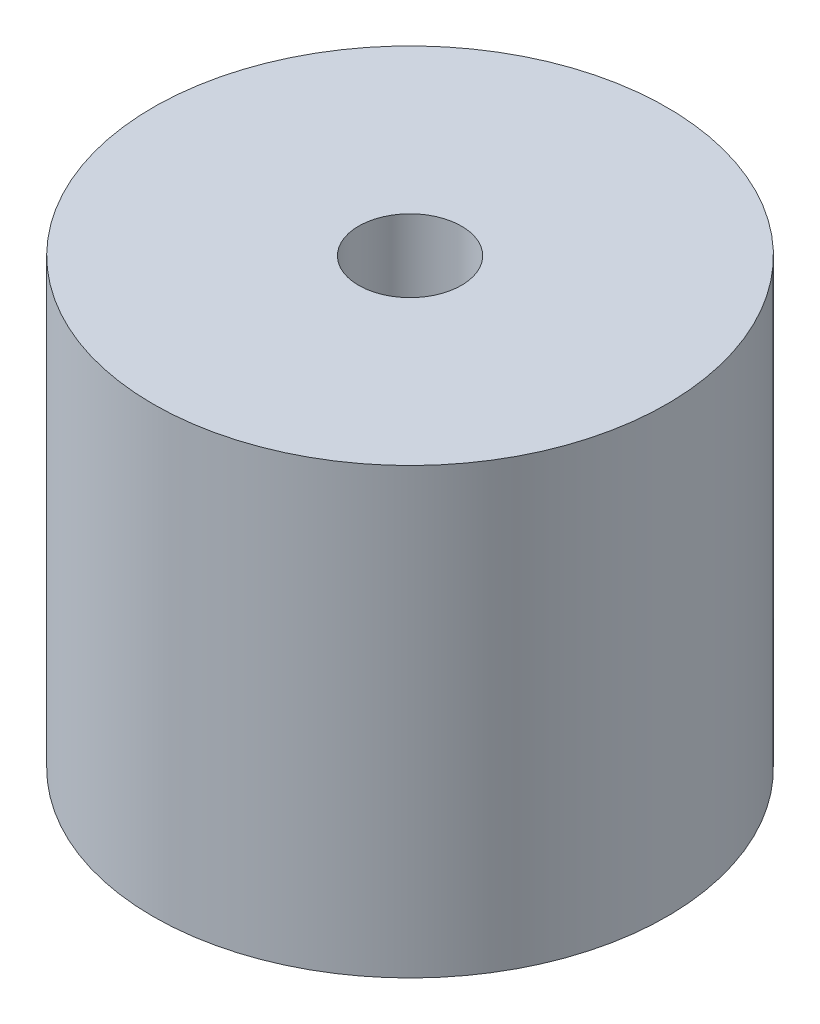
ISO-10303-21;
HEADER;
FILE_DESCRIPTION(('STEP AP214'),'2;1');
FILE_NAME('part.step','',(''),(''),'','','');
FILE_SCHEMA(('AUTOMOTIVE_DESIGN { 1 0 10303 214 1 1 1 1 }'));
ENDSEC;
DATA;
#1=APPLICATION_CONTEXT('core data for automotive mechanical design processes');
#2=APPLICATION_PROTOCOL_DEFINITION('international standard','automotive_design',2000,#1);
#3=PRODUCT_CONTEXT('',#1,'mechanical');
#4=PRODUCT('Part','Part','',(#3));
#5=PRODUCT_RELATED_PRODUCT_CATEGORY('part','',(#4));
#6=PRODUCT_DEFINITION_FORMATION('','',#4);
#7=PRODUCT_DEFINITION_CONTEXT('part definition',#1,'design');
#8=PRODUCT_DEFINITION('design','',#6,#7);
#9=PRODUCT_DEFINITION_SHAPE('','',#8);
#10=(LENGTH_UNIT() NAMED_UNIT(*) SI_UNIT(.MILLI.,.METRE.));
#11=(NAMED_UNIT(*) PLANE_ANGLE_UNIT() SI_UNIT($,.RADIAN.));
#12=(NAMED_UNIT(*) SI_UNIT($,.STERADIAN.) SOLID_ANGLE_UNIT());
#13=UNCERTAINTY_MEASURE_WITH_UNIT(LENGTH_MEASURE(1.E-05),#10,'distance_accuracy_value','');
#14=(GEOMETRIC_REPRESENTATION_CONTEXT(3) GLOBAL_UNCERTAINTY_ASSIGNED_CONTEXT((#13)) GLOBAL_UNIT_ASSIGNED_CONTEXT((#10,
#11,#12)) REPRESENTATION_CONTEXT('',''));
#15=CARTESIAN_POINT('',(0.,0.,0.));
#16=DIRECTION('',(0.,0.,1.));
#17=DIRECTION('',(1.,0.,0.));
#18=AXIS2_PLACEMENT_3D('',#15,#16,#17);
#19=CARTESIAN_POINT('',(0.,86.36,0.));
#20=DIRECTION('',(0.,1.,0.));
#21=DIRECTION('',(0.,0.,1.));
#22=AXIS2_PLACEMENT_3D('',#19,#20,#21);
#23=PLANE('',#22);
#24=CARTESIAN_POINT('',(0.,86.36,0.));
#25=DIRECTION('',(0.,1.,0.));
#26=DIRECTION('',(0.,0.,1.));
#27=AXIS2_PLACEMENT_3D('',#24,#25,#26);
#28=CIRCLE('',#27,50.);
#29=CARTESIAN_POINT('',(0.,86.36,50.));
#30=VERTEX_POINT('',#29);
#31=EDGE_CURVE('E10',#30,#30,#28,.T.);
#32=ORIENTED_EDGE('',*,*,#31,.T.);
#33=EDGE_LOOP('',(#32));
#34=FACE_BOUND('',#33,.T.);
#35=CARTESIAN_POINT('',(0.,86.36,0.));
#36=DIRECTION('',(0.,1.,0.));
#37=DIRECTION('',(0.,0.,1.));
#38=AXIS2_PLACEMENT_3D('',#35,#36,#37);
#39=CIRCLE('',#38,10.);
#40=CARTESIAN_POINT('',(0.,86.36,10.));
#41=VERTEX_POINT('',#40);
#42=EDGE_CURVE('E50',#41,#41,#39,.T.);
#43=ORIENTED_EDGE('',*,*,#42,.F.);
#44=EDGE_LOOP('',(#43));
#45=FACE_BOUND('',#44,.T.);
#46=ADVANCED_FACE('F37',(#34,#45),#23,.T.);
#47=CARTESIAN_POINT('',(0.,0.,0.));
#48=DIRECTION('',(0.,1.,0.));
#49=DIRECTION('',(0.,0.,1.));
#50=AXIS2_PLACEMENT_3D('',#47,#48,#49);
#51=PLANE('',#50);
#52=CARTESIAN_POINT('',(0.,0.,0.));
#53=DIRECTION('',(0.,1.,0.));
#54=DIRECTION('',(0.,0.,1.));
#55=AXIS2_PLACEMENT_3D('',#52,#53,#54);
#56=CIRCLE('',#55,50.);
#57=CARTESIAN_POINT('',(0.,0.,50.));
#58=VERTEX_POINT('',#57);
#59=EDGE_CURVE('E41',#58,#58,#56,.T.);
#60=ORIENTED_EDGE('',*,*,#59,.F.);
#61=EDGE_LOOP('',(#60));
#62=FACE_BOUND('',#61,.T.);
#63=CARTESIAN_POINT('',(0.,0.,0.));
#64=DIRECTION('',(0.,1.,0.));
#65=DIRECTION('',(0.,0.,1.));
#66=AXIS2_PLACEMENT_3D('',#63,#64,#65);
#67=CIRCLE('',#66,10.);
#68=CARTESIAN_POINT('',(0.,0.,10.));
#69=VERTEX_POINT('',#68);
#70=EDGE_CURVE('E52',#69,#69,#67,.T.);
#71=ORIENTED_EDGE('',*,*,#70,.T.);
#72=EDGE_LOOP('',(#71));
#73=FACE_BOUND('',#72,.T.);
#74=ADVANCED_FACE('F64',(#62,#73),#51,.F.);
#75=CARTESIAN_POINT('',(0.,86.36,0.));
#76=DIRECTION('',(0.,-1.,0.));
#77=DIRECTION('',(0.,0.,-1.));
#78=AXIS2_PLACEMENT_3D('',#75,#76,#77);
#79=CYLINDRICAL_SURFACE('',#78,50.);
#80=ORIENTED_EDGE('',*,*,#31,.F.);
#81=EDGE_LOOP('',(#80));
#82=FACE_BOUND('',#81,.T.);
#83=ORIENTED_EDGE('',*,*,#59,.T.);
#84=EDGE_LOOP('',(#83));
#85=FACE_BOUND('',#84,.T.);
#86=ADVANCED_FACE('F39',(#82,#85),#79,.T.);
#87=CARTESIAN_POINT('',(0.,86.36,0.));
#88=DIRECTION('',(0.,-1.,0.));
#89=DIRECTION('',(0.,0.,-1.));
#90=AXIS2_PLACEMENT_3D('',#87,#88,#89);
#91=CYLINDRICAL_SURFACE('',#90,10.);
#92=ORIENTED_EDGE('',*,*,#42,.T.);
#93=EDGE_LOOP('',(#92));
#94=FACE_BOUND('',#93,.T.);
#95=ORIENTED_EDGE('',*,*,#70,.F.);
#96=EDGE_LOOP('',(#95));
#97=FACE_BOUND('',#96,.T.);
#98=ADVANCED_FACE('F60',(#94,#97),#91,.F.);
#99=CLOSED_SHELL('',(#46,#74,#86,#98));
#100=MANIFOLD_SOLID_BREP('B2',#99);
#101=ADVANCED_BREP_SHAPE_REPRESENTATION('',(#18,#100),#14);
#102=SHAPE_DEFINITION_REPRESENTATION(#9,#101);
ENDSEC;
END-ISO-10303-21;
